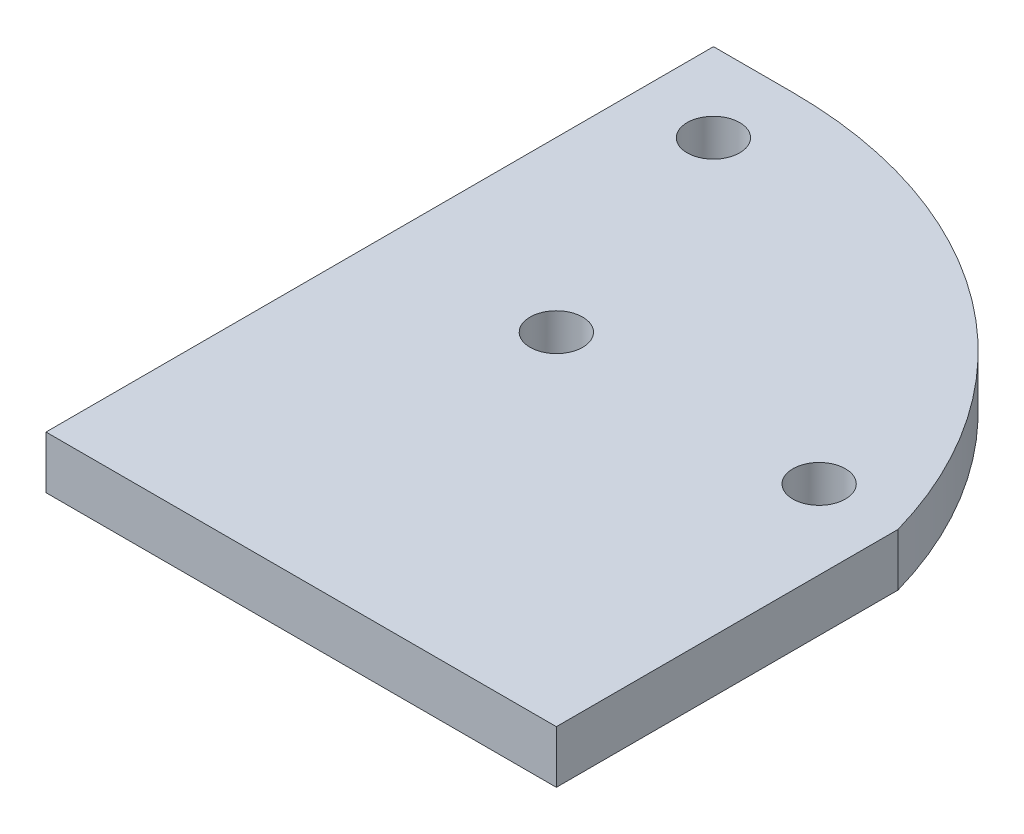
ISO-10303-21;
HEADER;
FILE_DESCRIPTION(('STEP AP214'),'2;1');
FILE_NAME('part.step','',(''),(''),'','','');
FILE_SCHEMA(('AUTOMOTIVE_DESIGN { 1 0 10303 214 1 1 1 1 }'));
ENDSEC;
DATA;
#1=APPLICATION_CONTEXT('core data for automotive mechanical design processes');
#2=APPLICATION_PROTOCOL_DEFINITION('international standard','automotive_design',2000,#1);
#3=PRODUCT_CONTEXT('',#1,'mechanical');
#4=PRODUCT('Part','Part','',(#3));
#5=PRODUCT_RELATED_PRODUCT_CATEGORY('part','',(#4));
#6=PRODUCT_DEFINITION_FORMATION('','',#4);
#7=PRODUCT_DEFINITION_CONTEXT('part definition',#1,'design');
#8=PRODUCT_DEFINITION('design','',#6,#7);
#9=PRODUCT_DEFINITION_SHAPE('','',#8);
#10=(LENGTH_UNIT() NAMED_UNIT(*) SI_UNIT(.MILLI.,.METRE.));
#11=(NAMED_UNIT(*) PLANE_ANGLE_UNIT() SI_UNIT($,.RADIAN.));
#12=(NAMED_UNIT(*) SI_UNIT($,.STERADIAN.) SOLID_ANGLE_UNIT());
#13=UNCERTAINTY_MEASURE_WITH_UNIT(LENGTH_MEASURE(1.E-05),#10,'distance_accuracy_value','');
#14=(GEOMETRIC_REPRESENTATION_CONTEXT(3) GLOBAL_UNCERTAINTY_ASSIGNED_CONTEXT((#13)) GLOBAL_UNIT_ASSIGNED_CONTEXT((#10,
#11,#12)) REPRESENTATION_CONTEXT('',''));
#15=CARTESIAN_POINT('',(0.,0.,0.));
#16=DIRECTION('',(0.,0.,1.));
#17=DIRECTION('',(1.,0.,0.));
#18=AXIS2_PLACEMENT_3D('',#15,#16,#17);
#19=CARTESIAN_POINT('',(0.,10.,0.));
#20=DIRECTION('',(0.,0.,-1.));
#21=DIRECTION('',(-1.,0.,0.));
#22=AXIS2_PLACEMENT_3D('',#19,#20,#21);
#23=PLANE('',#22);
#24=DIRECTION('',(1.,0.,0.));
#25=VECTOR('',#24,1.);
#26=CARTESIAN_POINT('',(0.,0.,0.));
#27=LINE('',#26,#25);
#28=CARTESIAN_POINT('',(0.,0.,0.));
#29=VERTEX_POINT('',#28);
#30=CARTESIAN_POINT('',(97.1,0.,0.));
#31=VERTEX_POINT('',#30);
#32=EDGE_CURVE('E120',#29,#31,#27,.T.);
#33=ORIENTED_EDGE('',*,*,#32,.T.);
#34=DIRECTION('',(0.,-1.,0.));
#35=VECTOR('',#34,1.);
#36=CARTESIAN_POINT('',(97.1,10.,0.));
#37=LINE('',#36,#35);
#38=CARTESIAN_POINT('',(97.1,10.,0.));
#39=VERTEX_POINT('',#38);
#40=EDGE_CURVE('E11',#39,#31,#37,.T.);
#41=ORIENTED_EDGE('',*,*,#40,.F.);
#42=DIRECTION('',(1.,0.,0.));
#43=VECTOR('',#42,1.);
#44=CARTESIAN_POINT('',(0.,10.,0.));
#45=LINE('',#44,#43);
#46=CARTESIAN_POINT('',(0.,10.,0.));
#47=VERTEX_POINT('',#46);
#48=EDGE_CURVE('E133',#47,#39,#45,.T.);
#49=ORIENTED_EDGE('',*,*,#48,.F.);
#50=DIRECTION('',(0.,-1.,0.));
#51=VECTOR('',#50,1.);
#52=CARTESIAN_POINT('',(0.,10.,0.));
#53=LINE('',#52,#51);
#54=EDGE_CURVE('E116',#47,#29,#53,.T.);
#55=ORIENTED_EDGE('',*,*,#54,.T.);
#56=EDGE_LOOP('',(#33,#41,#49,#55));
#57=FACE_BOUND('',#56,.T.);
#58=ADVANCED_FACE('F39',(#57),#23,.F.);
#59=CARTESIAN_POINT('',(97.1,10.,0.));
#60=DIRECTION('',(-1.,0.,0.));
#61=DIRECTION('',(0.,0.,1.));
#62=AXIS2_PLACEMENT_3D('',#59,#60,#61);
#63=PLANE('',#62);
#64=DIRECTION('',(0.,0.,-1.));
#65=VECTOR('',#64,1.);
#66=CARTESIAN_POINT('',(97.1,0.,0.));
#67=LINE('',#66,#65);
#68=CARTESIAN_POINT('',(97.1,0.,-65.));
#69=VERTEX_POINT('',#68);
#70=EDGE_CURVE('E124',#31,#69,#67,.T.);
#71=ORIENTED_EDGE('',*,*,#70,.T.);
#72=DIRECTION('',(0.,-1.,0.));
#73=VECTOR('',#72,1.);
#74=CARTESIAN_POINT('',(97.1,10.,-65.));
#75=LINE('',#74,#73);
#76=CARTESIAN_POINT('',(97.1,10.,-65.));
#77=VERTEX_POINT('',#76);
#78=EDGE_CURVE('E49',#77,#69,#75,.T.);
#79=ORIENTED_EDGE('',*,*,#78,.F.);
#80=DIRECTION('',(0.,0.,-1.));
#81=VECTOR('',#80,1.);
#82=CARTESIAN_POINT('',(97.1,10.,0.));
#83=LINE('',#82,#81);
#84=EDGE_CURVE('E92',#39,#77,#83,.T.);
#85=ORIENTED_EDGE('',*,*,#84,.F.);
#86=ORIENTED_EDGE('',*,*,#40,.T.);
#87=EDGE_LOOP('',(#71,#79,#85,#86));
#88=FACE_BOUND('',#87,.T.);
#89=ADVANCED_FACE('F179',(#88),#63,.F.);
#90=CARTESIAN_POINT('',(15.,10.,-41.6418548387097));
#91=DIRECTION('',(0.,-1.,0.));
#92=DIRECTION('',(0.,0.,-1.));
#93=AXIS2_PLACEMENT_3D('',#90,#91,#92);
#94=CYLINDRICAL_SURFACE('',#93,85.3581451612903);
#95=CARTESIAN_POINT('',(15.,0.,-41.6418548387097));
#96=DIRECTION('',(0.,1.,0.));
#97=DIRECTION('',(0.,0.,-1.));
#98=AXIS2_PLACEMENT_3D('',#95,#96,#97);
#99=CIRCLE('',#98,85.3581451612903);
#100=CARTESIAN_POINT('',(15.,0.,-127.));
#101=VERTEX_POINT('',#100);
#102=EDGE_CURVE('E108',#69,#101,#99,.T.);
#103=ORIENTED_EDGE('',*,*,#102,.T.);
#104=DIRECTION('',(0.,-1.,0.));
#105=VECTOR('',#104,1.);
#106=CARTESIAN_POINT('',(15.,10.,-127.));
#107=LINE('',#106,#105);
#108=CARTESIAN_POINT('',(15.,10.,-127.));
#109=VERTEX_POINT('',#108);
#110=EDGE_CURVE('E105',#109,#101,#107,.T.);
#111=ORIENTED_EDGE('',*,*,#110,.F.);
#112=CARTESIAN_POINT('',(15.,10.,-41.6418548387097));
#113=DIRECTION('',(0.,1.,0.));
#114=DIRECTION('',(0.,0.,-1.));
#115=AXIS2_PLACEMENT_3D('',#112,#113,#114);
#116=CIRCLE('',#115,85.3581451612903);
#117=EDGE_CURVE('E96',#77,#109,#116,.T.);
#118=ORIENTED_EDGE('',*,*,#117,.F.);
#119=ORIENTED_EDGE('',*,*,#78,.T.);
#120=EDGE_LOOP('',(#103,#111,#118,#119));
#121=FACE_BOUND('',#120,.T.);
#122=ADVANCED_FACE('F106',(#121),#94,.T.);
#123=CARTESIAN_POINT('',(0.,10.,-127.));
#124=DIRECTION('',(0.,0.,1.));
#125=DIRECTION('',(1.,0.,0.));
#126=AXIS2_PLACEMENT_3D('',#123,#124,#125);
#127=PLANE('',#126);
#128=DIRECTION('',(-1.,0.,0.));
#129=VECTOR('',#128,1.);
#130=CARTESIAN_POINT('',(0.,0.,-127.));
#131=LINE('',#130,#129);
#132=CARTESIAN_POINT('',(0.,0.,-127.));
#133=VERTEX_POINT('',#132);
#134=EDGE_CURVE('E78',#101,#133,#131,.T.);
#135=ORIENTED_EDGE('',*,*,#134,.T.);
#136=DIRECTION('',(0.,-1.,0.));
#137=VECTOR('',#136,1.);
#138=CARTESIAN_POINT('',(0.,10.,-127.));
#139=LINE('',#138,#137);
#140=CARTESIAN_POINT('',(0.,10.,-127.));
#141=VERTEX_POINT('',#140);
#142=EDGE_CURVE('E110',#141,#133,#139,.T.);
#143=ORIENTED_EDGE('',*,*,#142,.F.);
#144=DIRECTION('',(-1.,0.,0.));
#145=VECTOR('',#144,1.);
#146=CARTESIAN_POINT('',(0.,10.,-127.));
#147=LINE('',#146,#145);
#148=EDGE_CURVE('E100',#109,#141,#147,.T.);
#149=ORIENTED_EDGE('',*,*,#148,.F.);
#150=ORIENTED_EDGE('',*,*,#110,.T.);
#151=EDGE_LOOP('',(#135,#143,#149,#150));
#152=FACE_BOUND('',#151,.T.);
#153=ADVANCED_FACE('F112',(#152),#127,.F.);
#154=CARTESIAN_POINT('',(0.,10.,0.));
#155=DIRECTION('',(1.,0.,0.));
#156=DIRECTION('',(0.,0.,-1.));
#157=AXIS2_PLACEMENT_3D('',#154,#155,#156);
#158=PLANE('',#157);
#159=DIRECTION('',(0.,0.,1.));
#160=VECTOR('',#159,1.);
#161=CARTESIAN_POINT('',(0.,0.,0.));
#162=LINE('',#161,#160);
#163=EDGE_CURVE('E84',#133,#29,#162,.T.);
#164=ORIENTED_EDGE('',*,*,#163,.T.);
#165=ORIENTED_EDGE('',*,*,#54,.F.);
#166=DIRECTION('',(0.,0.,1.));
#167=VECTOR('',#166,1.);
#168=CARTESIAN_POINT('',(0.,10.,0.));
#169=LINE('',#168,#167);
#170=EDGE_CURVE('E58',#141,#47,#169,.T.);
#171=ORIENTED_EDGE('',*,*,#170,.F.);
#172=ORIENTED_EDGE('',*,*,#142,.T.);
#173=EDGE_LOOP('',(#164,#165,#171,#172));
#174=FACE_BOUND('',#173,.T.);
#175=ADVANCED_FACE('F168',(#174),#158,.F.);
#176=CARTESIAN_POINT('',(15.,10.,-41.6418548387097));
#177=DIRECTION('',(0.,-1.,0.));
#178=DIRECTION('',(0.,0.,-1.));
#179=AXIS2_PLACEMENT_3D('',#176,#177,#178);
#180=PLANE('',#179);
#181=CARTESIAN_POINT('',(14.9989928337167,10.,-111.984631039295));
#182=DIRECTION('',(0.,1.,0.));
#183=DIRECTION('',(0.,0.,1.));
#184=AXIS2_PLACEMENT_3D('',#181,#182,#183);
#185=CIRCLE('',#184,5.00000000000001);
#186=CARTESIAN_POINT('',(14.9989928337167,10.,-106.984631039295));
#187=VERTEX_POINT('',#186);
#188=EDGE_CURVE('E144',#187,#187,#185,.T.);
#189=ORIENTED_EDGE('',*,*,#188,.F.);
#190=EDGE_LOOP('',(#189));
#191=FACE_BOUND('',#190,.T.);
#192=CARTESIAN_POINT('',(82.1,10.,-65.));
#193=DIRECTION('',(0.,1.,0.));
#194=DIRECTION('',(0.,0.,1.));
#195=AXIS2_PLACEMENT_3D('',#192,#193,#194);
#196=CIRCLE('',#195,5.00000000000001);
#197=CARTESIAN_POINT('',(82.1,10.,-60.));
#198=VERTEX_POINT('',#197);
#199=EDGE_CURVE('E242',#198,#198,#196,.T.);
#200=ORIENTED_EDGE('',*,*,#199,.F.);
#201=EDGE_LOOP('',(#200));
#202=FACE_BOUND('',#201,.T.);
#203=CARTESIAN_POINT('',(32.1,10.,-65.));
#204=DIRECTION('',(0.,1.,0.));
#205=DIRECTION('',(0.,0.,1.));
#206=AXIS2_PLACEMENT_3D('',#203,#204,#205);
#207=CIRCLE('',#206,4.99999999999999);
#208=CARTESIAN_POINT('',(32.1,10.,-60.));
#209=VERTEX_POINT('',#208);
#210=EDGE_CURVE('E245',#209,#209,#207,.T.);
#211=ORIENTED_EDGE('',*,*,#210,.F.);
#212=EDGE_LOOP('',(#211));
#213=FACE_BOUND('',#212,.T.);
#214=ORIENTED_EDGE('',*,*,#48,.T.);
#215=ORIENTED_EDGE('',*,*,#84,.T.);
#216=ORIENTED_EDGE('',*,*,#117,.T.);
#217=ORIENTED_EDGE('',*,*,#148,.T.);
#218=ORIENTED_EDGE('',*,*,#170,.T.);
#219=EDGE_LOOP('',(#214,#215,#216,#217,#218));
#220=FACE_BOUND('',#219,.T.);
#221=ADVANCED_FACE('F98',(#191,#202,#213,#220),#180,.F.);
#222=CARTESIAN_POINT('',(15.,0.,-41.6418548387097));
#223=DIRECTION('',(0.,-1.,0.));
#224=DIRECTION('',(0.,0.,-1.));
#225=AXIS2_PLACEMENT_3D('',#222,#223,#224);
#226=PLANE('',#225);
#227=CARTESIAN_POINT('',(14.9989928337167,0.,-111.984631039295));
#228=DIRECTION('',(0.,-1.,0.));
#229=DIRECTION('',(0.,0.,-1.));
#230=AXIS2_PLACEMENT_3D('',#227,#228,#229);
#231=CIRCLE('',#230,5.00000000000001);
#232=CARTESIAN_POINT('',(14.9989928337167,0.,-116.984631039295));
#233=VERTEX_POINT('',#232);
#234=EDGE_CURVE('E42',#233,#233,#231,.T.);
#235=ORIENTED_EDGE('',*,*,#234,.F.);
#236=EDGE_LOOP('',(#235));
#237=FACE_BOUND('',#236,.T.);
#238=CARTESIAN_POINT('',(82.1,0.,-65.));
#239=DIRECTION('',(0.,-1.,0.));
#240=DIRECTION('',(0.,0.,-1.));
#241=AXIS2_PLACEMENT_3D('',#238,#239,#240);
#242=CIRCLE('',#241,5.00000000000001);
#243=CARTESIAN_POINT('',(82.1,0.,-70.));
#244=VERTEX_POINT('',#243);
#245=EDGE_CURVE('E143',#244,#244,#242,.T.);
#246=ORIENTED_EDGE('',*,*,#245,.F.);
#247=EDGE_LOOP('',(#246));
#248=FACE_BOUND('',#247,.T.);
#249=CARTESIAN_POINT('',(32.1,0.,-65.));
#250=DIRECTION('',(0.,-1.,0.));
#251=DIRECTION('',(0.,0.,-1.));
#252=AXIS2_PLACEMENT_3D('',#249,#250,#251);
#253=CIRCLE('',#252,4.99999999999999);
#254=CARTESIAN_POINT('',(32.1,0.,-70.));
#255=VERTEX_POINT('',#254);
#256=EDGE_CURVE('E140',#255,#255,#253,.T.);
#257=ORIENTED_EDGE('',*,*,#256,.F.);
#258=EDGE_LOOP('',(#257));
#259=FACE_BOUND('',#258,.T.);
#260=ORIENTED_EDGE('',*,*,#32,.F.);
#261=ORIENTED_EDGE('',*,*,#163,.F.);
#262=ORIENTED_EDGE('',*,*,#134,.F.);
#263=ORIENTED_EDGE('',*,*,#102,.F.);
#264=ORIENTED_EDGE('',*,*,#70,.F.);
#265=EDGE_LOOP('',(#260,#261,#262,#263,#264));
#266=FACE_BOUND('',#265,.T.);
#267=ADVANCED_FACE('F156',(#237,#248,#259,#266),#226,.T.);
#268=CARTESIAN_POINT('',(32.1,-1.2E-05,-65.));
#269=DIRECTION('',(0.,1.,0.));
#270=DIRECTION('',(0.,0.,1.));
#271=AXIS2_PLACEMENT_3D('',#268,#269,#270);
#272=CYLINDRICAL_SURFACE('',#271,4.99999999999999);
#273=ORIENTED_EDGE('',*,*,#256,.T.);
#274=EDGE_LOOP('',(#273));
#275=FACE_BOUND('',#274,.T.);
#276=ORIENTED_EDGE('',*,*,#210,.T.);
#277=EDGE_LOOP('',(#276));
#278=FACE_BOUND('',#277,.T.);
#279=ADVANCED_FACE('F159',(#275,#278),#272,.F.);
#280=CARTESIAN_POINT('',(82.1,-1.2E-05,-65.));
#281=DIRECTION('',(0.,1.,0.));
#282=DIRECTION('',(0.,0.,1.));
#283=AXIS2_PLACEMENT_3D('',#280,#281,#282);
#284=CYLINDRICAL_SURFACE('',#283,5.00000000000001);
#285=ORIENTED_EDGE('',*,*,#245,.T.);
#286=EDGE_LOOP('',(#285));
#287=FACE_BOUND('',#286,.T.);
#288=ORIENTED_EDGE('',*,*,#199,.T.);
#289=EDGE_LOOP('',(#288));
#290=FACE_BOUND('',#289,.T.);
#291=ADVANCED_FACE('F218',(#287,#290),#284,.F.);
#292=CARTESIAN_POINT('',(14.9989928337167,-1.2E-05,-111.984631039295));
#293=DIRECTION('',(0.,1.,0.));
#294=DIRECTION('',(0.,0.,1.));
#295=AXIS2_PLACEMENT_3D('',#292,#293,#294);
#296=CYLINDRICAL_SURFACE('',#295,5.00000000000001);
#297=ORIENTED_EDGE('',*,*,#234,.T.);
#298=EDGE_LOOP('',(#297));
#299=FACE_BOUND('',#298,.T.);
#300=ORIENTED_EDGE('',*,*,#188,.T.);
#301=EDGE_LOOP('',(#300));
#302=FACE_BOUND('',#301,.T.);
#303=ADVANCED_FACE('F153',(#299,#302),#296,.F.);
#304=CLOSED_SHELL('',(#58,#89,#122,#153,#175,#221,#267,#279,#291,#303));
#305=MANIFOLD_SOLID_BREP('B2',#304);
#306=ADVANCED_BREP_SHAPE_REPRESENTATION('',(#18,#305),#14);
#307=SHAPE_DEFINITION_REPRESENTATION(#9,#306);
ENDSEC;
END-ISO-10303-21;
